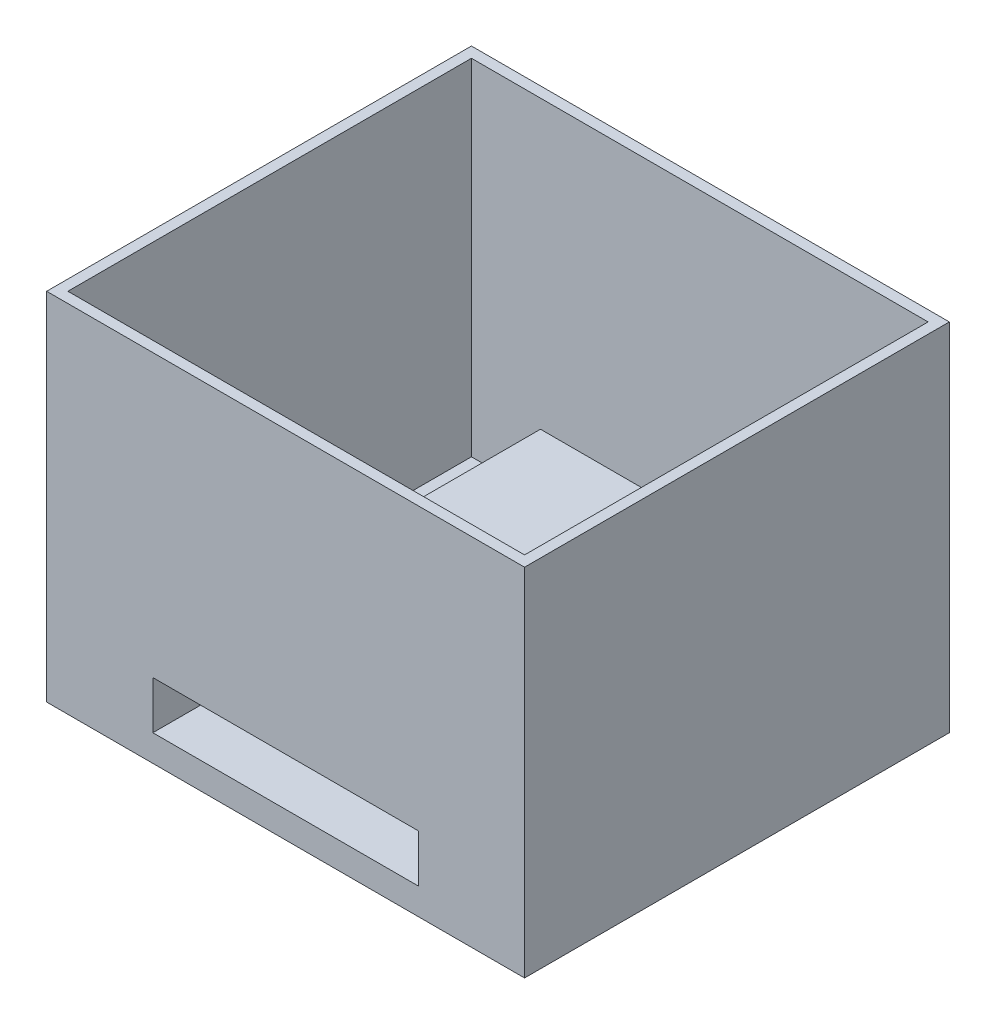
ISO-10303-21;
HEADER;
FILE_DESCRIPTION(('STEP AP214'),'2;1');
FILE_NAME('part.step','',(''),(''),'','','');
FILE_SCHEMA(('AUTOMOTIVE_DESIGN { 1 0 10303 214 1 1 1 1 }'));
ENDSEC;
DATA;
#1=APPLICATION_CONTEXT('core data for automotive mechanical design processes');
#2=APPLICATION_PROTOCOL_DEFINITION('international standard','automotive_design',2000,#1);
#3=PRODUCT_CONTEXT('',#1,'mechanical');
#4=PRODUCT('Part','Part','',(#3));
#5=PRODUCT_RELATED_PRODUCT_CATEGORY('part','',(#4));
#6=PRODUCT_DEFINITION_FORMATION('','',#4);
#7=PRODUCT_DEFINITION_CONTEXT('part definition',#1,'design');
#8=PRODUCT_DEFINITION('design','',#6,#7);
#9=PRODUCT_DEFINITION_SHAPE('','',#8);
#10=(LENGTH_UNIT() NAMED_UNIT(*) SI_UNIT(.MILLI.,.METRE.));
#11=(NAMED_UNIT(*) PLANE_ANGLE_UNIT() SI_UNIT($,.RADIAN.));
#12=(NAMED_UNIT(*) SI_UNIT($,.STERADIAN.) SOLID_ANGLE_UNIT());
#13=UNCERTAINTY_MEASURE_WITH_UNIT(LENGTH_MEASURE(1.E-05),#10,'distance_accuracy_value','');
#14=(GEOMETRIC_REPRESENTATION_CONTEXT(3) GLOBAL_UNCERTAINTY_ASSIGNED_CONTEXT((#13)) GLOBAL_UNIT_ASSIGNED_CONTEXT((#10,
#11,#12)) REPRESENTATION_CONTEXT('',''));
#15=CARTESIAN_POINT('',(0.,0.,0.));
#16=DIRECTION('',(0.,0.,1.));
#17=DIRECTION('',(1.,0.,0.));
#18=AXIS2_PLACEMENT_3D('',#15,#16,#17);
#19=CARTESIAN_POINT('',(-8.78698323075499,44.7669640792051,98.5856221030969));
#20=DIRECTION('',(0.,-1.,0.));
#21=DIRECTION('',(0.,0.,-1.));
#22=AXIS2_PLACEMENT_3D('',#19,#20,#21);
#23=PLANE('',#22);
#24=DIRECTION('',(-1.,0.,0.));
#25=VECTOR('',#24,1.);
#26=CARTESIAN_POINT('',(-8.78698323075499,44.7669640792051,18.5856221030968));
#27=LINE('',#26,#25);
#28=CARTESIAN_POINT('',(81.213016769245,44.7669640792051,18.5856221030968));
#29=VERTEX_POINT('',#28);
#30=CARTESIAN_POINT('',(-8.78698323075499,44.7669640792051,18.5856221030968));
#31=VERTEX_POINT('',#30);
#32=EDGE_CURVE('E248',#29,#31,#27,.T.);
#33=ORIENTED_EDGE('',*,*,#32,.T.);
#34=DIRECTION('',(0.,0.,-1.));
#35=VECTOR('',#34,1.);
#36=CARTESIAN_POINT('',(-8.78698323075499,44.7669640792051,98.5856221030969));
#37=LINE('',#36,#35);
#38=CARTESIAN_POINT('',(-8.78698323075499,44.7669640792051,98.5856221030969));
#39=VERTEX_POINT('',#38);
#40=EDGE_CURVE('E254',#39,#31,#37,.T.);
#41=ORIENTED_EDGE('',*,*,#40,.F.);
#42=DIRECTION('',(-1.,0.,0.));
#43=VECTOR('',#42,1.);
#44=CARTESIAN_POINT('',(-8.78698323075499,44.7669640792051,98.5856221030969));
#45=LINE('',#44,#43);
#46=CARTESIAN_POINT('',(81.213016769245,44.7669640792051,98.5856221030969));
#47=VERTEX_POINT('',#46);
#48=EDGE_CURVE('E252',#47,#39,#45,.T.);
#49=ORIENTED_EDGE('',*,*,#48,.F.);
#50=DIRECTION('',(0.,0.,-1.));
#51=VECTOR('',#50,1.);
#52=CARTESIAN_POINT('',(81.213016769245,44.7669640792051,98.5856221030969));
#53=LINE('',#52,#51);
#54=EDGE_CURVE('E264',#47,#29,#53,.T.);
#55=ORIENTED_EDGE('',*,*,#54,.T.);
#56=EDGE_LOOP('',(#33,#41,#49,#55));
#57=FACE_BOUND('',#56,.T.);
#58=DIRECTION('',(-1.,0.,0.));
#59=VECTOR('',#58,1.);
#60=CARTESIAN_POINT('',(-8.78698323075499,44.7669640792051,20.5856221030968));
#61=LINE('',#60,#59);
#62=CARTESIAN_POINT('',(79.213016769245,44.7669640792051,20.5856221030968));
#63=VERTEX_POINT('',#62);
#64=CARTESIAN_POINT('',(-6.78698323075499,44.7669640792051,20.5856221030968));
#65=VERTEX_POINT('',#64);
#66=EDGE_CURVE('E224',#63,#65,#61,.T.);
#67=ORIENTED_EDGE('',*,*,#66,.F.);
#68=DIRECTION('',(0.,0.,-1.));
#69=VECTOR('',#68,1.);
#70=CARTESIAN_POINT('',(79.213016769245,44.7669640792051,98.5856221030969));
#71=LINE('',#70,#69);
#72=CARTESIAN_POINT('',(79.213016769245,44.7669640792051,96.5856221030969));
#73=VERTEX_POINT('',#72);
#74=EDGE_CURVE('E229',#73,#63,#71,.T.);
#75=ORIENTED_EDGE('',*,*,#74,.F.);
#76=DIRECTION('',(-1.,0.,0.));
#77=VECTOR('',#76,1.);
#78=CARTESIAN_POINT('',(-8.78698323075499,44.7669640792051,96.5856221030969));
#79=LINE('',#78,#77);
#80=CARTESIAN_POINT('',(-6.78698323075499,44.7669640792051,96.5856221030969));
#81=VERTEX_POINT('',#80);
#82=EDGE_CURVE('E235',#73,#81,#79,.T.);
#83=ORIENTED_EDGE('',*,*,#82,.T.);
#84=DIRECTION('',(0.,0.,-1.));
#85=VECTOR('',#84,1.);
#86=CARTESIAN_POINT('',(-6.78698323075499,44.7669640792051,98.5856221030969));
#87=LINE('',#86,#85);
#88=EDGE_CURVE('E236',#81,#65,#87,.T.);
#89=ORIENTED_EDGE('',*,*,#88,.T.);
#90=EDGE_LOOP('',(#67,#75,#83,#89));
#91=FACE_BOUND('',#90,.T.);
#92=ADVANCED_FACE('F34',(#57,#91),#23,.F.);
#93=CARTESIAN_POINT('',(-8.78698323075499,44.7669640792051,98.5856221030969));
#94=DIRECTION('',(1.,0.,0.));
#95=DIRECTION('',(0.,1.,0.));
#96=AXIS2_PLACEMENT_3D('',#93,#94,#95);
#97=PLANE('',#96);
#98=DIRECTION('',(0.,-1.,0.));
#99=VECTOR('',#98,1.);
#100=CARTESIAN_POINT('',(-8.78698323075499,44.7669640792051,18.5856221030968));
#101=LINE('',#100,#99);
#102=CARTESIAN_POINT('',(-8.78698323075498,-22.2330359207949,18.5856221030968));
#103=VERTEX_POINT('',#102);
#104=EDGE_CURVE('E218',#31,#103,#101,.T.);
#105=ORIENTED_EDGE('',*,*,#104,.T.);
#106=DIRECTION('',(0.,0.,-1.));
#107=VECTOR('',#106,1.);
#108=CARTESIAN_POINT('',(-8.78698323075498,-22.2330359207949,98.5856221030969));
#109=LINE('',#108,#107);
#110=CARTESIAN_POINT('',(-8.78698323075498,-22.2330359207949,98.5856221030969));
#111=VERTEX_POINT('',#110);
#112=EDGE_CURVE('E270',#111,#103,#109,.T.);
#113=ORIENTED_EDGE('',*,*,#112,.F.);
#114=DIRECTION('',(0.,-1.,0.));
#115=VECTOR('',#114,1.);
#116=CARTESIAN_POINT('',(-8.78698323075499,44.7669640792051,98.5856221030969));
#117=LINE('',#116,#115);
#118=EDGE_CURVE('E244',#39,#111,#117,.T.);
#119=ORIENTED_EDGE('',*,*,#118,.F.);
#120=ORIENTED_EDGE('',*,*,#40,.T.);
#121=EDGE_LOOP('',(#105,#113,#119,#120));
#122=FACE_BOUND('',#121,.T.);
#123=ADVANCED_FACE('F36',(#122),#97,.F.);
#124=CARTESIAN_POINT('',(-8.78698323075498,-22.2330359207949,98.5856221030969));
#125=DIRECTION('',(0.,1.,0.));
#126=DIRECTION('',(0.,0.,1.));
#127=AXIS2_PLACEMENT_3D('',#124,#125,#126);
#128=PLANE('',#127);
#129=DIRECTION('',(1.,0.,0.));
#130=VECTOR('',#129,1.);
#131=CARTESIAN_POINT('',(-8.78698323075498,-22.2330359207949,18.5856221030968));
#132=LINE('',#131,#130);
#133=CARTESIAN_POINT('',(81.213016769245,-22.2330359207949,18.5856221030968));
#134=VERTEX_POINT('',#133);
#135=EDGE_CURVE('E257',#103,#134,#132,.T.);
#136=ORIENTED_EDGE('',*,*,#135,.T.);
#137=DIRECTION('',(0.,0.,-1.));
#138=VECTOR('',#137,1.);
#139=CARTESIAN_POINT('',(81.213016769245,-22.2330359207949,98.5856221030969));
#140=LINE('',#139,#138);
#141=CARTESIAN_POINT('',(81.213016769245,-22.2330359207949,98.5856221030969));
#142=VERTEX_POINT('',#141);
#143=EDGE_CURVE('E267',#142,#134,#140,.T.);
#144=ORIENTED_EDGE('',*,*,#143,.F.);
#145=DIRECTION('',(1.,0.,0.));
#146=VECTOR('',#145,1.);
#147=CARTESIAN_POINT('',(-8.78698323075498,-22.2330359207949,98.5856221030969));
#148=LINE('',#147,#146);
#149=EDGE_CURVE('E247',#111,#142,#148,.T.);
#150=ORIENTED_EDGE('',*,*,#149,.F.);
#151=ORIENTED_EDGE('',*,*,#112,.T.);
#152=EDGE_LOOP('',(#136,#144,#150,#151));
#153=FACE_BOUND('',#152,.T.);
#154=ADVANCED_FACE('F309',(#153),#128,.F.);
#155=CARTESIAN_POINT('',(81.213016769245,44.7669640792051,98.5856221030969));
#156=DIRECTION('',(-1.,0.,0.));
#157=DIRECTION('',(0.,-1.,0.));
#158=AXIS2_PLACEMENT_3D('',#155,#156,#157);
#159=PLANE('',#158);
#160=DIRECTION('',(0.,1.,0.));
#161=VECTOR('',#160,1.);
#162=CARTESIAN_POINT('',(81.213016769245,44.7669640792051,18.5856221030968));
#163=LINE('',#162,#161);
#164=EDGE_CURVE('E259',#134,#29,#163,.T.);
#165=ORIENTED_EDGE('',*,*,#164,.T.);
#166=ORIENTED_EDGE('',*,*,#54,.F.);
#167=DIRECTION('',(0.,1.,0.));
#168=VECTOR('',#167,1.);
#169=CARTESIAN_POINT('',(81.213016769245,44.7669640792051,98.5856221030969));
#170=LINE('',#169,#168);
#171=EDGE_CURVE('E250',#142,#47,#170,.T.);
#172=ORIENTED_EDGE('',*,*,#171,.F.);
#173=ORIENTED_EDGE('',*,*,#143,.T.);
#174=EDGE_LOOP('',(#165,#166,#172,#173));
#175=FACE_BOUND('',#174,.T.);
#176=ADVANCED_FACE('F316',(#175),#159,.F.);
#177=CARTESIAN_POINT('',(0.,0.,98.5856221030969));
#178=DIRECTION('',(0.,0.,1.));
#179=DIRECTION('',(1.,0.,0.));
#180=AXIS2_PLACEMENT_3D('',#177,#178,#179);
#181=PLANE('',#180);
#182=DIRECTION('',(0.,1.,0.));
#183=VECTOR('',#182,1.);
#184=CARTESIAN_POINT('',(61.213016769245,0.,98.5856221030969));
#185=LINE('',#184,#183);
#186=CARTESIAN_POINT('',(61.213016769245,-17.2330359207949,98.5856221030969));
#187=VERTEX_POINT('',#186);
#188=CARTESIAN_POINT('',(61.213016769245,-8.23303592079491,98.5856221030969));
#189=VERTEX_POINT('',#188);
#190=EDGE_CURVE('E157',#187,#189,#185,.T.);
#191=ORIENTED_EDGE('',*,*,#190,.F.);
#192=DIRECTION('',(1.,0.,0.));
#193=VECTOR('',#192,1.);
#194=CARTESIAN_POINT('',(0.,-17.2330359207949,98.5856221030969));
#195=LINE('',#194,#193);
#196=CARTESIAN_POINT('',(11.213016769245,-17.2330359207949,98.5856221030969));
#197=VERTEX_POINT('',#196);
#198=EDGE_CURVE('E158',#197,#187,#195,.T.);
#199=ORIENTED_EDGE('',*,*,#198,.F.);
#200=DIRECTION('',(0.,-1.,0.));
#201=VECTOR('',#200,1.);
#202=CARTESIAN_POINT('',(11.213016769245,0.,98.5856221030969));
#203=LINE('',#202,#201);
#204=CARTESIAN_POINT('',(11.213016769245,-8.23303592079492,98.5856221030969));
#205=VERTEX_POINT('',#204);
#206=EDGE_CURVE('E162',#205,#197,#203,.T.);
#207=ORIENTED_EDGE('',*,*,#206,.F.);
#208=DIRECTION('',(-1.,0.,0.));
#209=VECTOR('',#208,1.);
#210=CARTESIAN_POINT('',(0.,-8.23303592079492,98.5856221030969));
#211=LINE('',#210,#209);
#212=EDGE_CURVE('E147',#189,#205,#211,.T.);
#213=ORIENTED_EDGE('',*,*,#212,.F.);
#214=EDGE_LOOP('',(#191,#199,#207,#213));
#215=FACE_BOUND('',#214,.T.);
#216=ORIENTED_EDGE('',*,*,#118,.T.);
#217=ORIENTED_EDGE('',*,*,#149,.T.);
#218=ORIENTED_EDGE('',*,*,#171,.T.);
#219=ORIENTED_EDGE('',*,*,#48,.T.);
#220=EDGE_LOOP('',(#216,#217,#218,#219));
#221=FACE_BOUND('',#220,.T.);
#222=ADVANCED_FACE('F168',(#215,#221),#181,.T.);
#223=CARTESIAN_POINT('',(0.,0.,18.5856221030968));
#224=DIRECTION('',(0.,0.,1.));
#225=DIRECTION('',(1.,0.,0.));
#226=AXIS2_PLACEMENT_3D('',#223,#224,#225);
#227=PLANE('',#226);
#228=ORIENTED_EDGE('',*,*,#104,.F.);
#229=ORIENTED_EDGE('',*,*,#32,.F.);
#230=ORIENTED_EDGE('',*,*,#164,.F.);
#231=ORIENTED_EDGE('',*,*,#135,.F.);
#232=EDGE_LOOP('',(#228,#229,#230,#231));
#233=FACE_BOUND('',#232,.T.);
#234=ADVANCED_FACE('F314',(#233),#227,.F.);
#235=CARTESIAN_POINT('',(-6.78698323075499,44.7669640792051,98.5856221030969));
#236=DIRECTION('',(1.,0.,0.));
#237=DIRECTION('',(0.,1.,0.));
#238=AXIS2_PLACEMENT_3D('',#235,#236,#237);
#239=PLANE('',#238);
#240=DIRECTION('',(0.,-1.,0.));
#241=VECTOR('',#240,1.);
#242=CARTESIAN_POINT('',(-6.78698323075499,44.7669640792051,20.5856221030968));
#243=LINE('',#242,#241);
#244=CARTESIAN_POINT('',(-6.78698323075498,-20.2330359207949,20.5856221030968));
#245=VERTEX_POINT('',#244);
#246=EDGE_CURVE('E204',#65,#245,#243,.T.);
#247=ORIENTED_EDGE('',*,*,#246,.F.);
#248=ORIENTED_EDGE('',*,*,#88,.F.);
#249=DIRECTION('',(0.,-1.,0.));
#250=VECTOR('',#249,1.);
#251=CARTESIAN_POINT('',(-6.78698323075499,44.7669640792051,96.5856221030969));
#252=LINE('',#251,#250);
#253=CARTESIAN_POINT('',(-6.78698323075498,-20.2330359207949,96.5856221030969));
#254=VERTEX_POINT('',#253);
#255=EDGE_CURVE('E220',#81,#254,#252,.T.);
#256=ORIENTED_EDGE('',*,*,#255,.T.);
#257=DIRECTION('',(0.,0.,-1.));
#258=VECTOR('',#257,1.);
#259=CARTESIAN_POINT('',(-6.78698323075498,-20.2330359207949,98.5856221030969));
#260=LINE('',#259,#258);
#261=EDGE_CURVE('E215',#254,#245,#260,.T.);
#262=ORIENTED_EDGE('',*,*,#261,.T.);
#263=EDGE_LOOP('',(#247,#248,#256,#262));
#264=FACE_BOUND('',#263,.T.);
#265=ADVANCED_FACE('F338',(#264),#239,.T.);
#266=CARTESIAN_POINT('',(-8.78698323075498,-20.2330359207949,98.5856221030969));
#267=DIRECTION('',(0.,1.,0.));
#268=DIRECTION('',(0.,0.,1.));
#269=AXIS2_PLACEMENT_3D('',#266,#267,#268);
#270=PLANE('',#269);
#271=DIRECTION('',(1.,0.,0.));
#272=VECTOR('',#271,1.);
#273=CARTESIAN_POINT('',(-8.78698323075498,-20.2330359207949,20.5856221030968));
#274=LINE('',#273,#272);
#275=CARTESIAN_POINT('',(79.213016769245,-20.2330359207949,20.5856221030968));
#276=VERTEX_POINT('',#275);
#277=EDGE_CURVE('E214',#245,#276,#274,.T.);
#278=ORIENTED_EDGE('',*,*,#277,.F.);
#279=ORIENTED_EDGE('',*,*,#261,.F.);
#280=DIRECTION('',(1.,0.,0.));
#281=VECTOR('',#280,1.);
#282=CARTESIAN_POINT('',(-8.78698323075498,-20.2330359207949,96.5856221030969));
#283=LINE('',#282,#281);
#284=CARTESIAN_POINT('',(79.213016769245,-20.2330359207949,96.5856221030969));
#285=VERTEX_POINT('',#284);
#286=EDGE_CURVE('E223',#254,#285,#283,.T.);
#287=ORIENTED_EDGE('',*,*,#286,.T.);
#288=DIRECTION('',(0.,0.,-1.));
#289=VECTOR('',#288,1.);
#290=CARTESIAN_POINT('',(79.213016769245,-20.2330359207949,98.5856221030969));
#291=LINE('',#290,#289);
#292=EDGE_CURVE('E219',#285,#276,#291,.T.);
#293=ORIENTED_EDGE('',*,*,#292,.T.);
#294=EDGE_LOOP('',(#278,#279,#287,#293));
#295=FACE_BOUND('',#294,.T.);
#296=ADVANCED_FACE('F349',(#295),#270,.T.);
#297=CARTESIAN_POINT('',(79.213016769245,44.7669640792051,98.5856221030969));
#298=DIRECTION('',(-1.,0.,0.));
#299=DIRECTION('',(0.,-1.,0.));
#300=AXIS2_PLACEMENT_3D('',#297,#298,#299);
#301=PLANE('',#300);
#302=DIRECTION('',(0.,1.,0.));
#303=VECTOR('',#302,1.);
#304=CARTESIAN_POINT('',(79.213016769245,44.7669640792051,20.5856221030968));
#305=LINE('',#304,#303);
#306=EDGE_CURVE('E226',#276,#63,#305,.T.);
#307=ORIENTED_EDGE('',*,*,#306,.F.);
#308=ORIENTED_EDGE('',*,*,#292,.F.);
#309=DIRECTION('',(0.,1.,0.));
#310=VECTOR('',#309,1.);
#311=CARTESIAN_POINT('',(79.213016769245,44.7669640792051,96.5856221030969));
#312=LINE('',#311,#310);
#313=EDGE_CURVE('E231',#285,#73,#312,.T.);
#314=ORIENTED_EDGE('',*,*,#313,.T.);
#315=ORIENTED_EDGE('',*,*,#74,.T.);
#316=EDGE_LOOP('',(#307,#308,#314,#315));
#317=FACE_BOUND('',#316,.T.);
#318=ADVANCED_FACE('F346',(#317),#301,.T.);
#319=CARTESIAN_POINT('',(0.,0.,96.5856221030969));
#320=DIRECTION('',(0.,0.,1.));
#321=DIRECTION('',(1.,0.,0.));
#322=AXIS2_PLACEMENT_3D('',#319,#320,#321);
#323=PLANE('',#322);
#324=DIRECTION('',(-1.,0.,0.));
#325=VECTOR('',#324,1.);
#326=CARTESIAN_POINT('',(0.,-6.23303592079492,96.5856221030969));
#327=LINE('',#326,#325);
#328=CARTESIAN_POINT('',(63.213016769245,-6.23303592079491,96.5856221030969));
#329=VERTEX_POINT('',#328);
#330=CARTESIAN_POINT('',(9.21301676924503,-6.23303592079492,96.5856221030969));
#331=VERTEX_POINT('',#330);
#332=EDGE_CURVE('E274',#329,#331,#327,.T.);
#333=ORIENTED_EDGE('',*,*,#332,.T.);
#334=DIRECTION('',(0.,-1.,0.));
#335=VECTOR('',#334,1.);
#336=CARTESIAN_POINT('',(9.21301676924502,0.,96.5856221030969));
#337=LINE('',#336,#335);
#338=CARTESIAN_POINT('',(9.21301676924503,-19.2330359207949,96.5856221030969));
#339=VERTEX_POINT('',#338);
#340=EDGE_CURVE('E11',#331,#339,#337,.T.);
#341=ORIENTED_EDGE('',*,*,#340,.T.);
#342=DIRECTION('',(1.,0.,0.));
#343=VECTOR('',#342,1.);
#344=CARTESIAN_POINT('',(0.,-19.2330359207949,96.5856221030969));
#345=LINE('',#344,#343);
#346=CARTESIAN_POINT('',(63.213016769245,-19.2330359207949,96.5856221030969));
#347=VERTEX_POINT('',#346);
#348=EDGE_CURVE('E56',#339,#347,#345,.T.);
#349=ORIENTED_EDGE('',*,*,#348,.T.);
#350=DIRECTION('',(0.,1.,0.));
#351=VECTOR('',#350,1.);
#352=CARTESIAN_POINT('',(63.213016769245,0.,96.5856221030969));
#353=LINE('',#352,#351);
#354=EDGE_CURVE('E42',#347,#329,#353,.T.);
#355=ORIENTED_EDGE('',*,*,#354,.T.);
#356=EDGE_LOOP('',(#333,#341,#349,#355));
#357=FACE_BOUND('',#356,.T.);
#358=ORIENTED_EDGE('',*,*,#255,.F.);
#359=ORIENTED_EDGE('',*,*,#82,.F.);
#360=ORIENTED_EDGE('',*,*,#313,.F.);
#361=ORIENTED_EDGE('',*,*,#286,.F.);
#362=EDGE_LOOP('',(#358,#359,#360,#361));
#363=FACE_BOUND('',#362,.T.);
#364=ADVANCED_FACE('F276',(#357,#363),#323,.F.);
#365=CARTESIAN_POINT('',(0.,0.,20.5856221030968));
#366=DIRECTION('',(0.,0.,1.));
#367=DIRECTION('',(1.,0.,0.));
#368=AXIS2_PLACEMENT_3D('',#365,#366,#367);
#369=PLANE('',#368);
#370=ORIENTED_EDGE('',*,*,#246,.T.);
#371=ORIENTED_EDGE('',*,*,#277,.T.);
#372=ORIENTED_EDGE('',*,*,#306,.T.);
#373=ORIENTED_EDGE('',*,*,#66,.T.);
#374=EDGE_LOOP('',(#370,#371,#372,#373));
#375=FACE_BOUND('',#374,.T.);
#376=ADVANCED_FACE('F340',(#375),#369,.T.);
#377=CARTESIAN_POINT('',(9.21301676924503,-6.23303592079492,23.5856221030969));
#378=DIRECTION('',(-1.,0.,0.));
#379=DIRECTION('',(0.,-1.,0.));
#380=AXIS2_PLACEMENT_3D('',#377,#378,#379);
#381=PLANE('',#380);
#382=ORIENTED_EDGE('',*,*,#340,.F.);
#383=DIRECTION('',(0.,0.,1.));
#384=VECTOR('',#383,1.);
#385=CARTESIAN_POINT('',(9.21301676924503,-6.23303592079492,23.5856221030969));
#386=LINE('',#385,#384);
#387=CARTESIAN_POINT('',(9.21301676924503,-6.23303592079492,23.5856221030969));
#388=VERTEX_POINT('',#387);
#389=EDGE_CURVE('E201',#388,#331,#386,.T.);
#390=ORIENTED_EDGE('',*,*,#389,.F.);
#391=DIRECTION('',(0.,-1.,0.));
#392=VECTOR('',#391,1.);
#393=CARTESIAN_POINT('',(9.21301676924503,-6.23303592079492,23.5856221030969));
#394=LINE('',#393,#392);
#395=CARTESIAN_POINT('',(9.21301676924503,-19.2330359207949,23.5856221030969));
#396=VERTEX_POINT('',#395);
#397=EDGE_CURVE('E170',#388,#396,#394,.T.);
#398=ORIENTED_EDGE('',*,*,#397,.T.);
#399=DIRECTION('',(0.,0.,1.));
#400=VECTOR('',#399,1.);
#401=CARTESIAN_POINT('',(9.21301676924503,-19.2330359207949,23.5856221030969));
#402=LINE('',#401,#400);
#403=EDGE_CURVE('E200',#396,#339,#402,.T.);
#404=ORIENTED_EDGE('',*,*,#403,.T.);
#405=EDGE_LOOP('',(#382,#390,#398,#404));
#406=FACE_BOUND('',#405,.T.);
#407=ADVANCED_FACE('F287',(#406),#381,.T.);
#408=CARTESIAN_POINT('',(63.213016769245,-6.23303592079491,23.5856221030969));
#409=DIRECTION('',(1.,0.,0.));
#410=DIRECTION('',(0.,0.,-1.));
#411=AXIS2_PLACEMENT_3D('',#408,#409,#410);
#412=PLANE('',#411);
#413=ORIENTED_EDGE('',*,*,#354,.F.);
#414=DIRECTION('',(0.,0.,1.));
#415=VECTOR('',#414,1.);
#416=CARTESIAN_POINT('',(63.213016769245,-19.2330359207949,23.5856221030969));
#417=LINE('',#416,#415);
#418=CARTESIAN_POINT('',(63.213016769245,-19.2330359207949,23.5856221030969));
#419=VERTEX_POINT('',#418);
#420=EDGE_CURVE('E208',#419,#347,#417,.T.);
#421=ORIENTED_EDGE('',*,*,#420,.F.);
#422=DIRECTION('',(0.,1.,0.));
#423=VECTOR('',#422,1.);
#424=CARTESIAN_POINT('',(63.213016769245,-6.23303592079491,23.5856221030969));
#425=LINE('',#424,#423);
#426=CARTESIAN_POINT('',(63.213016769245,-6.23303592079491,23.5856221030969));
#427=VERTEX_POINT('',#426);
#428=EDGE_CURVE('E194',#419,#427,#425,.T.);
#429=ORIENTED_EDGE('',*,*,#428,.T.);
#430=DIRECTION('',(0.,0.,1.));
#431=VECTOR('',#430,1.);
#432=CARTESIAN_POINT('',(63.213016769245,-6.23303592079491,23.5856221030969));
#433=LINE('',#432,#431);
#434=EDGE_CURVE('E205',#427,#329,#433,.T.);
#435=ORIENTED_EDGE('',*,*,#434,.T.);
#436=EDGE_LOOP('',(#413,#421,#429,#435));
#437=FACE_BOUND('',#436,.T.);
#438=ADVANCED_FACE('F280',(#437),#412,.T.);
#439=CARTESIAN_POINT('',(9.21301676924503,-6.23303592079492,23.5856221030969));
#440=DIRECTION('',(0.,1.,0.));
#441=DIRECTION('',(-1.,0.,0.));
#442=AXIS2_PLACEMENT_3D('',#439,#440,#441);
#443=PLANE('',#442);
#444=ORIENTED_EDGE('',*,*,#332,.F.);
#445=ORIENTED_EDGE('',*,*,#434,.F.);
#446=DIRECTION('',(-1.,0.,0.));
#447=VECTOR('',#446,1.);
#448=CARTESIAN_POINT('',(9.21301676924503,-6.23303592079492,23.5856221030969));
#449=LINE('',#448,#447);
#450=EDGE_CURVE('E197',#427,#388,#449,.T.);
#451=ORIENTED_EDGE('',*,*,#450,.T.);
#452=ORIENTED_EDGE('',*,*,#389,.T.);
#453=EDGE_LOOP('',(#444,#445,#451,#452));
#454=FACE_BOUND('',#453,.T.);
#455=ADVANCED_FACE('F284',(#454),#443,.T.);
#456=CARTESIAN_POINT('',(9.21301676924503,-19.2330359207949,23.5856221030969));
#457=DIRECTION('',(0.,-1.,0.));
#458=DIRECTION('',(1.,0.,0.));
#459=AXIS2_PLACEMENT_3D('',#456,#457,#458);
#460=PLANE('',#459);
#461=ORIENTED_EDGE('',*,*,#348,.F.);
#462=ORIENTED_EDGE('',*,*,#403,.F.);
#463=DIRECTION('',(1.,0.,0.));
#464=VECTOR('',#463,1.);
#465=CARTESIAN_POINT('',(9.21301676924503,-19.2330359207949,23.5856221030969));
#466=LINE('',#465,#464);
#467=EDGE_CURVE('E173',#396,#419,#466,.T.);
#468=ORIENTED_EDGE('',*,*,#467,.T.);
#469=ORIENTED_EDGE('',*,*,#420,.T.);
#470=EDGE_LOOP('',(#461,#462,#468,#469));
#471=FACE_BOUND('',#470,.T.);
#472=ADVANCED_FACE('F292',(#471),#460,.T.);
#473=CARTESIAN_POINT('',(0.,0.,23.5856221030969));
#474=DIRECTION('',(0.,0.,1.));
#475=DIRECTION('',(1.,0.,0.));
#476=AXIS2_PLACEMENT_3D('',#473,#474,#475);
#477=PLANE('',#476);
#478=ORIENTED_EDGE('',*,*,#397,.F.);
#479=ORIENTED_EDGE('',*,*,#450,.F.);
#480=ORIENTED_EDGE('',*,*,#428,.F.);
#481=ORIENTED_EDGE('',*,*,#467,.F.);
#482=EDGE_LOOP('',(#478,#479,#480,#481));
#483=FACE_BOUND('',#482,.T.);
#484=ADVANCED_FACE('F290',(#483),#477,.F.);
#485=CARTESIAN_POINT('',(11.213016769245,-6.23303592079492,23.5856221030969));
#486=DIRECTION('',(-1.,0.,0.));
#487=DIRECTION('',(0.,-1.,0.));
#488=AXIS2_PLACEMENT_3D('',#485,#486,#487);
#489=PLANE('',#488);
#490=ORIENTED_EDGE('',*,*,#206,.T.);
#491=DIRECTION('',(0.,0.,1.));
#492=VECTOR('',#491,1.);
#493=CARTESIAN_POINT('',(11.213016769245,-17.2330359207949,23.5856221030969));
#494=LINE('',#493,#492);
#495=CARTESIAN_POINT('',(11.213016769245,-17.2330359207949,25.5856221030969));
#496=VERTEX_POINT('',#495);
#497=EDGE_CURVE('E49',#496,#197,#494,.T.);
#498=ORIENTED_EDGE('',*,*,#497,.F.);
#499=DIRECTION('',(0.,-1.,0.));
#500=VECTOR('',#499,1.);
#501=CARTESIAN_POINT('',(11.213016769245,0.,25.5856221030969));
#502=LINE('',#501,#500);
#503=CARTESIAN_POINT('',(11.213016769245,-8.23303592079492,25.5856221030969));
#504=VERTEX_POINT('',#503);
#505=EDGE_CURVE('E165',#504,#496,#502,.T.);
#506=ORIENTED_EDGE('',*,*,#505,.F.);
#507=DIRECTION('',(0.,0.,1.));
#508=VECTOR('',#507,1.);
#509=CARTESIAN_POINT('',(11.213016769245,-8.23303592079492,23.5856221030969));
#510=LINE('',#509,#508);
#511=EDGE_CURVE('E151',#504,#205,#510,.T.);
#512=ORIENTED_EDGE('',*,*,#511,.T.);
#513=EDGE_LOOP('',(#490,#498,#506,#512));
#514=FACE_BOUND('',#513,.T.);
#515=ADVANCED_FACE('F161',(#514),#489,.F.);
#516=CARTESIAN_POINT('',(61.213016769245,-6.23303592079491,23.5856221030969));
#517=DIRECTION('',(1.,0.,0.));
#518=DIRECTION('',(0.,0.,-1.));
#519=AXIS2_PLACEMENT_3D('',#516,#517,#518);
#520=PLANE('',#519);
#521=ORIENTED_EDGE('',*,*,#190,.T.);
#522=DIRECTION('',(0.,0.,1.));
#523=VECTOR('',#522,1.);
#524=CARTESIAN_POINT('',(61.213016769245,-8.23303592079491,23.5856221030969));
#525=LINE('',#524,#523);
#526=CARTESIAN_POINT('',(61.213016769245,-8.23303592079491,25.5856221030969));
#527=VERTEX_POINT('',#526);
#528=EDGE_CURVE('E153',#527,#189,#525,.T.);
#529=ORIENTED_EDGE('',*,*,#528,.F.);
#530=DIRECTION('',(0.,1.,0.));
#531=VECTOR('',#530,1.);
#532=CARTESIAN_POINT('',(61.213016769245,0.,25.5856221030969));
#533=LINE('',#532,#531);
#534=CARTESIAN_POINT('',(61.213016769245,-17.2330359207949,25.5856221030969));
#535=VERTEX_POINT('',#534);
#536=EDGE_CURVE('E185',#535,#527,#533,.T.);
#537=ORIENTED_EDGE('',*,*,#536,.F.);
#538=DIRECTION('',(0.,0.,1.));
#539=VECTOR('',#538,1.);
#540=CARTESIAN_POINT('',(61.213016769245,-17.2330359207949,23.5856221030969));
#541=LINE('',#540,#539);
#542=EDGE_CURVE('E181',#535,#187,#541,.T.);
#543=ORIENTED_EDGE('',*,*,#542,.T.);
#544=EDGE_LOOP('',(#521,#529,#537,#543));
#545=FACE_BOUND('',#544,.T.);
#546=ADVANCED_FACE('F372',(#545),#520,.F.);
#547=CARTESIAN_POINT('',(9.21301676924503,-8.23303592079492,23.5856221030969));
#548=DIRECTION('',(0.,1.,0.));
#549=DIRECTION('',(-1.,0.,0.));
#550=AXIS2_PLACEMENT_3D('',#547,#548,#549);
#551=PLANE('',#550);
#552=ORIENTED_EDGE('',*,*,#212,.T.);
#553=ORIENTED_EDGE('',*,*,#511,.F.);
#554=DIRECTION('',(-1.,0.,0.));
#555=VECTOR('',#554,1.);
#556=CARTESIAN_POINT('',(0.,-8.23303592079492,25.5856221030969));
#557=LINE('',#556,#555);
#558=EDGE_CURVE('E182',#527,#504,#557,.T.);
#559=ORIENTED_EDGE('',*,*,#558,.F.);
#560=ORIENTED_EDGE('',*,*,#528,.T.);
#561=EDGE_LOOP('',(#552,#553,#559,#560));
#562=FACE_BOUND('',#561,.T.);
#563=ADVANCED_FACE('F149',(#562),#551,.F.);
#564=CARTESIAN_POINT('',(9.21301676924503,-17.2330359207949,23.5856221030969));
#565=DIRECTION('',(0.,-1.,0.));
#566=DIRECTION('',(1.,0.,0.));
#567=AXIS2_PLACEMENT_3D('',#564,#565,#566);
#568=PLANE('',#567);
#569=ORIENTED_EDGE('',*,*,#198,.T.);
#570=ORIENTED_EDGE('',*,*,#542,.F.);
#571=DIRECTION('',(1.,0.,0.));
#572=VECTOR('',#571,1.);
#573=CARTESIAN_POINT('',(0.,-17.2330359207949,25.5856221030969));
#574=LINE('',#573,#572);
#575=EDGE_CURVE('E179',#496,#535,#574,.T.);
#576=ORIENTED_EDGE('',*,*,#575,.F.);
#577=ORIENTED_EDGE('',*,*,#497,.T.);
#578=EDGE_LOOP('',(#569,#570,#576,#577));
#579=FACE_BOUND('',#578,.T.);
#580=ADVANCED_FACE('F366',(#579),#568,.F.);
#581=CARTESIAN_POINT('',(0.,0.,25.5856221030969));
#582=DIRECTION('',(0.,0.,1.));
#583=DIRECTION('',(1.,0.,0.));
#584=AXIS2_PLACEMENT_3D('',#581,#582,#583);
#585=PLANE('',#584);
#586=ORIENTED_EDGE('',*,*,#505,.T.);
#587=ORIENTED_EDGE('',*,*,#575,.T.);
#588=ORIENTED_EDGE('',*,*,#536,.T.);
#589=ORIENTED_EDGE('',*,*,#558,.T.);
#590=EDGE_LOOP('',(#586,#587,#588,#589));
#591=FACE_BOUND('',#590,.T.);
#592=ADVANCED_FACE('F363',(#591),#585,.T.);
#593=CLOSED_SHELL('',(#92,#123,#154,#176,#222,#234,#265,#296,#318,#364,#376,#407,#438,#455,#472,
#484,#515,#546,#563,#580,#592));
#594=MANIFOLD_SOLID_BREP('B2',#593);
#595=ADVANCED_BREP_SHAPE_REPRESENTATION('',(#18,#594),#14);
#596=SHAPE_DEFINITION_REPRESENTATION(#9,#595);
ENDSEC;
END-ISO-10303-21;
